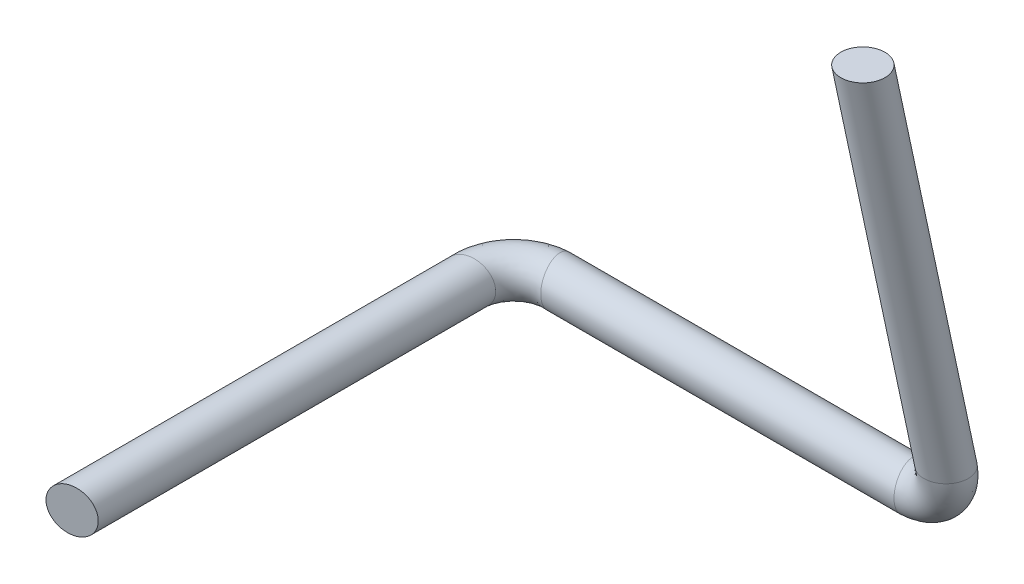
ISO-10303-21;
HEADER;
FILE_DESCRIPTION(('STEP AP214'),'2;1');
FILE_NAME('part.step','',(''),(''),'','','');
FILE_SCHEMA(('AUTOMOTIVE_DESIGN { 1 0 10303 214 1 1 1 1 }'));
ENDSEC;
DATA;
#1=APPLICATION_CONTEXT('core data for automotive mechanical design processes');
#2=APPLICATION_PROTOCOL_DEFINITION('international standard','automotive_design',2000,#1);
#3=PRODUCT_CONTEXT('',#1,'mechanical');
#4=PRODUCT('Part','Part','',(#3));
#5=PRODUCT_RELATED_PRODUCT_CATEGORY('part','',(#4));
#6=PRODUCT_DEFINITION_FORMATION('','',#4);
#7=PRODUCT_DEFINITION_CONTEXT('part definition',#1,'design');
#8=PRODUCT_DEFINITION('design','',#6,#7);
#9=PRODUCT_DEFINITION_SHAPE('','',#8);
#10=(LENGTH_UNIT() NAMED_UNIT(*) SI_UNIT(.MILLI.,.METRE.));
#11=(NAMED_UNIT(*) PLANE_ANGLE_UNIT() SI_UNIT($,.RADIAN.));
#12=(NAMED_UNIT(*) SI_UNIT($,.STERADIAN.) SOLID_ANGLE_UNIT());
#13=UNCERTAINTY_MEASURE_WITH_UNIT(LENGTH_MEASURE(1.E-05),#10,'distance_accuracy_value','');
#14=(GEOMETRIC_REPRESENTATION_CONTEXT(3) GLOBAL_UNCERTAINTY_ASSIGNED_CONTEXT((#13)) GLOBAL_UNIT_ASSIGNED_CONTEXT((#10,
#11,#12)) REPRESENTATION_CONTEXT('',''));
#15=CARTESIAN_POINT('',(0.,0.,0.));
#16=DIRECTION('',(0.,0.,1.));
#17=DIRECTION('',(1.,0.,0.));
#18=AXIS2_PLACEMENT_3D('',#15,#16,#17);
#19=CARTESIAN_POINT('',(-99.9576178643243,-97.792191514469,-10.8970209013628));
#20=DIRECTION('',(-0.204443194398825,0.0432632424090822,-0.97792191514469));
#21=DIRECTION('',(0.956312936234163,-0.204443194398823,-0.20897020901363));
#22=AXIS2_PLACEMENT_3D('',#19,#20,#21);
#23=CIRCLE('',#22,5.);
#24=DIRECTION('',(0.,0.,1.));
#25=VECTOR('',#24,1.);
#26=SURFACE_OF_LINEAR_EXTRUSION('',#23,#25);
#27=CARTESIAN_POINT('',(-95.1760531831535,-98.8144074864631,-11.941871946431));
#28=VERTEX_POINT('',#27);
#29=EDGE_CURVE('E37',#28,#28,#23,.T.);
#30=ORIENTED_EDGE('',*,*,#29,.F.);
#31=EDGE_LOOP('',(#30));
#32=FACE_BOUND('',#31,.T.);
#33=CARTESIAN_POINT('',(-99.9576178643243,-97.792191514469,79.1029790986372));
#34=DIRECTION('',(-0.204443194398825,0.0432632424090822,-0.97792191514469));
#35=DIRECTION('',(0.956312936234163,-0.204443194398823,-0.20897020901363));
#36=AXIS2_PLACEMENT_3D('',#33,#34,#35);
#37=CIRCLE('',#36,5.);
#38=CARTESIAN_POINT('',(-95.1760531831535,-98.8144074864631,78.058128053569));
#39=VERTEX_POINT('',#38);
#40=EDGE_CURVE('E10',#39,#39,#37,.T.);
#41=ORIENTED_EDGE('',*,*,#40,.T.);
#42=EDGE_LOOP('',(#41));
#43=FACE_BOUND('',#42,.T.);
#44=ADVANCED_FACE('F31',(#32,#43),#26,.F.);
#45=CARTESIAN_POINT('',(-89.9576178643242,-97.792191514469,-20.8970209013628));
#46=DIRECTION('',(0.97792191514469,0.0432632424090822,-0.204443194398823));
#47=DIRECTION('',(0.208970209013629,-0.204443194398823,0.956312936234163));
#48=AXIS2_PLACEMENT_3D('',#45,#46,#47);
#49=CIRCLE('',#48,5.);
#50=CARTESIAN_POINT('',(-89.9576178643243,-97.792191514469,-10.8970209013628));
#51=DIRECTION('',(0.,1.,0.));
#52=AXIS1_PLACEMENT('',#50,#51);
#53=SURFACE_OF_REVOLUTION('',#49,#52);
#54=CARTESIAN_POINT('',(-88.9127668192561,-98.8144074864631,-16.115456220192));
#55=VERTEX_POINT('',#54);
#56=EDGE_CURVE('E41',#55,#55,#49,.T.);
#57=ORIENTED_EDGE('',*,*,#56,.F.);
#58=EDGE_LOOP('',(#57));
#59=FACE_BOUND('',#58,.T.);
#60=ORIENTED_EDGE('',*,*,#29,.T.);
#61=EDGE_LOOP('',(#60));
#62=FACE_BOUND('',#61,.T.);
#63=ADVANCED_FACE('F52',(#59,#62),#53,.T.);
#64=CARTESIAN_POINT('',(-9.96185697639532,-97.792191514469,-20.8970209013628));
#65=DIRECTION('',(0.97792191514469,0.0432632424090822,-0.204443194398823));
#66=DIRECTION('',(0.208970209013629,-0.204443194398823,0.956312936234163));
#67=AXIS2_PLACEMENT_3D('',#64,#65,#66);
#68=CIRCLE('',#67,5.);
#69=DIRECTION('',(-1.,0.,0.));
#70=VECTOR('',#69,1.);
#71=SURFACE_OF_LINEAR_EXTRUSION('',#68,#70);
#72=CARTESIAN_POINT('',(-8.91700593132717,-98.8144074864631,-16.115456220192));
#73=VERTEX_POINT('',#72);
#74=EDGE_CURVE('E45',#73,#73,#68,.T.);
#75=ORIENTED_EDGE('',*,*,#74,.F.);
#76=EDGE_LOOP('',(#75));
#77=FACE_BOUND('',#76,.T.);
#78=ORIENTED_EDGE('',*,*,#56,.T.);
#79=EDGE_LOOP('',(#78));
#80=FACE_BOUND('',#79,.T.);
#81=ADVANCED_FACE('F55',(#77,#80),#71,.F.);
#82=CARTESIAN_POINT('',(0.0381421254819197,-88.0088268424271,-18.806432963091));
#83=DIRECTION('',(0.,1.,0.));
#84=DIRECTION('',(0.,0.,1.));
#85=AXIS2_PLACEMENT_3D('',#82,#83,#84);
#86=CIRCLE('',#85,5.);
#87=CARTESIAN_POINT('',(-9.96185697639533,-88.0129714847281,-18.8073186235456));
#88=DIRECTION('',(0.,0.20897022778172,-0.97792200297409));
#89=AXIS1_PLACEMENT('',#87,#88);
#90=SURFACE_OF_REVOLUTION('',#86,#89);
#91=CARTESIAN_POINT('',(0.0381421254819197,-88.0088268424271,-13.806432963091));
#92=VERTEX_POINT('',#91);
#93=EDGE_CURVE('E67',#92,#92,#86,.T.);
#94=ORIENTED_EDGE('',*,*,#93,.F.);
#95=EDGE_LOOP('',(#94));
#96=FACE_BOUND('',#95,.T.);
#97=ORIENTED_EDGE('',*,*,#74,.T.);
#98=EDGE_LOOP('',(#97));
#99=FACE_BOUND('',#98,.T.);
#100=ADVANCED_FACE('F59',(#96,#99),#90,.T.);
#101=DIRECTION('',(-0.000423821356757212,0.97792191514469,0.208970209013628));
#102=VECTOR('',#101,1.);
#103=SURFACE_OF_LINEAR_EXTRUSION('',#86,#102);
#104=ORIENTED_EDGE('',*,*,#93,.T.);
#105=EDGE_LOOP('',(#104));
#106=FACE_BOUND('',#105,.T.);
#107=CARTESIAN_POINT('',(0.,0.,0.));
#108=DIRECTION('',(0.,1.,0.));
#109=DIRECTION('',(0.,0.,1.));
#110=AXIS2_PLACEMENT_3D('',#107,#108,#109);
#111=CIRCLE('',#110,5.);
#112=CARTESIAN_POINT('',(0.,0.,5.));
#113=VERTEX_POINT('',#112);
#114=EDGE_CURVE('E70',#113,#113,#111,.T.);
#115=ORIENTED_EDGE('',*,*,#114,.F.);
#116=EDGE_LOOP('',(#115));
#117=FACE_BOUND('',#116,.T.);
#118=ADVANCED_FACE('F64',(#106,#117),#103,.T.);
#119=CARTESIAN_POINT('',(-99.9576178643243,-97.792191514469,79.1029790986372));
#120=DIRECTION('',(-0.204443194398825,0.0432632424090822,-0.97792191514469));
#121=DIRECTION('',(0.956312936234163,-0.204443194398823,-0.20897020901363));
#122=AXIS2_PLACEMENT_3D('',#119,#120,#121);
#123=PLANE('',#122);
#124=ORIENTED_EDGE('',*,*,#40,.F.);
#125=EDGE_LOOP('',(#124));
#126=FACE_BOUND('',#125,.T.);
#127=ADVANCED_FACE('F78',(#126),#123,.F.);
#128=CARTESIAN_POINT('',(0.,0.,0.));
#129=DIRECTION('',(0.,1.,0.));
#130=DIRECTION('',(0.,0.,1.));
#131=AXIS2_PLACEMENT_3D('',#128,#129,#130);
#132=PLANE('',#131);
#133=ORIENTED_EDGE('',*,*,#114,.T.);
#134=EDGE_LOOP('',(#133));
#135=FACE_BOUND('',#134,.T.);
#136=ADVANCED_FACE('F75',(#135),#132,.T.);
#137=CLOSED_SHELL('',(#44,#63,#81,#100,#118,#127,#136));
#138=MANIFOLD_SOLID_BREP('B2',#137);
#139=ADVANCED_BREP_SHAPE_REPRESENTATION('',(#18,#138),#14);
#140=SHAPE_DEFINITION_REPRESENTATION(#9,#139);
ENDSEC;
END-ISO-10303-21;
